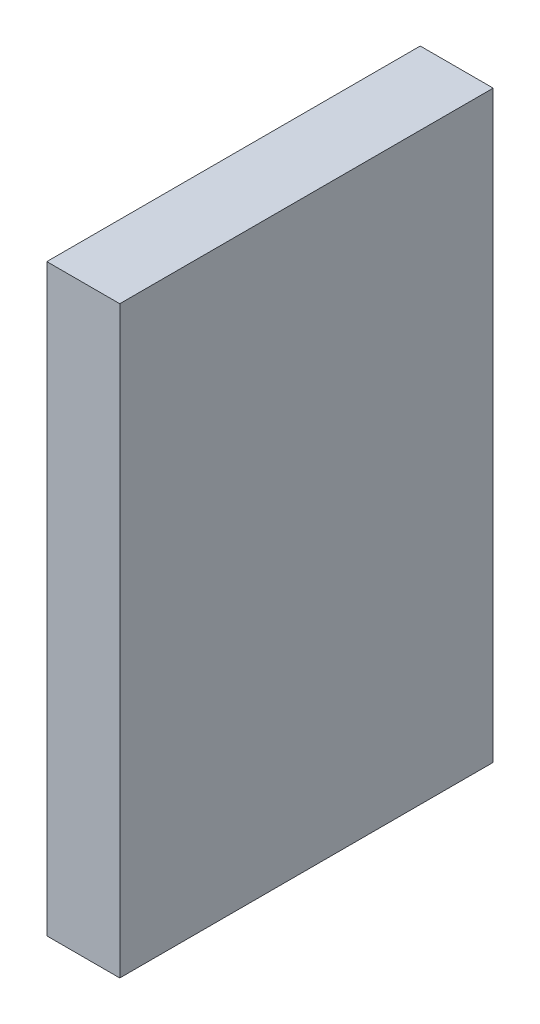
ISO-10303-21;
HEADER;
FILE_DESCRIPTION(('STEP AP214'),'2;1');
FILE_NAME('part.step','',(''),(''),'','','');
FILE_SCHEMA(('AUTOMOTIVE_DESIGN { 1 0 10303 214 1 1 1 1 }'));
ENDSEC;
DATA;
#1=APPLICATION_CONTEXT('core data for automotive mechanical design processes');
#2=APPLICATION_PROTOCOL_DEFINITION('international standard','automotive_design',2000,#1);
#3=PRODUCT_CONTEXT('',#1,'mechanical');
#4=PRODUCT('Part','Part','',(#3));
#5=PRODUCT_RELATED_PRODUCT_CATEGORY('part','',(#4));
#6=PRODUCT_DEFINITION_FORMATION('','',#4);
#7=PRODUCT_DEFINITION_CONTEXT('part definition',#1,'design');
#8=PRODUCT_DEFINITION('design','',#6,#7);
#9=PRODUCT_DEFINITION_SHAPE('','',#8);
#10=(LENGTH_UNIT() NAMED_UNIT(*) SI_UNIT(.MILLI.,.METRE.));
#11=(NAMED_UNIT(*) PLANE_ANGLE_UNIT() SI_UNIT($,.RADIAN.));
#12=(NAMED_UNIT(*) SI_UNIT($,.STERADIAN.) SOLID_ANGLE_UNIT());
#13=UNCERTAINTY_MEASURE_WITH_UNIT(LENGTH_MEASURE(1.E-05),#10,'distance_accuracy_value','');
#14=(GEOMETRIC_REPRESENTATION_CONTEXT(3) GLOBAL_UNCERTAINTY_ASSIGNED_CONTEXT((#13)) GLOBAL_UNIT_ASSIGNED_CONTEXT((#10,
#11,#12)) REPRESENTATION_CONTEXT('',''));
#15=CARTESIAN_POINT('',(0.,0.,0.));
#16=DIRECTION('',(0.,0.,1.));
#17=DIRECTION('',(1.,0.,0.));
#18=AXIS2_PLACEMENT_3D('',#15,#16,#17);
#19=CARTESIAN_POINT('',(0.64949324,-5.19949176,0.));
#20=DIRECTION('',(-1.,0.,0.));
#21=DIRECTION('',(0.,0.,1.));
#22=AXIS2_PLACEMENT_3D('',#19,#20,#21);
#23=PLANE('',#22);
#24=DIRECTION('',(0.,0.,-1.));
#25=VECTOR('',#24,1.);
#26=CARTESIAN_POINT('',(0.64949324,5.1994943,0.));
#27=LINE('',#26,#25);
#28=CARTESIAN_POINT('',(0.64949324,5.1994943,0.));
#29=VERTEX_POINT('',#28);
#30=CARTESIAN_POINT('',(0.64949324,5.1994943,6.65000194));
#31=VERTEX_POINT('',#30);
#32=EDGE_CURVE('E20',#29,#31,#27,.F.);
#33=ORIENTED_EDGE('',*,*,#32,.T.);
#34=DIRECTION('',(0.,1.,0.));
#35=VECTOR('',#34,1.);
#36=CARTESIAN_POINT('',(0.64949324,5.1994943,6.65000194));
#37=LINE('',#36,#35);
#38=CARTESIAN_POINT('',(0.64949324,-5.19949176,6.65000194));
#39=VERTEX_POINT('',#38);
#40=EDGE_CURVE('E55',#31,#39,#37,.F.);
#41=ORIENTED_EDGE('',*,*,#40,.T.);
#42=DIRECTION('',(0.,0.,1.));
#43=VECTOR('',#42,1.);
#44=CARTESIAN_POINT('',(0.64949324,-5.19949176,0.));
#45=LINE('',#44,#43);
#46=CARTESIAN_POINT('',(0.64949324,-5.19949176,0.));
#47=VERTEX_POINT('',#46);
#48=EDGE_CURVE('E76',#39,#47,#45,.F.);
#49=ORIENTED_EDGE('',*,*,#48,.T.);
#50=DIRECTION('',(0.,1.,0.));
#51=VECTOR('',#50,1.);
#52=CARTESIAN_POINT('',(0.64949324,5.1994943,0.));
#53=LINE('',#52,#51);
#54=EDGE_CURVE('E58',#29,#47,#53,.F.);
#55=ORIENTED_EDGE('',*,*,#54,.F.);
#56=EDGE_LOOP('',(#33,#41,#49,#55));
#57=FACE_BOUND('',#56,.T.);
#58=ADVANCED_FACE('F17',(#57),#23,.F.);
#59=CARTESIAN_POINT('',(0.64949324,5.1994943,0.));
#60=DIRECTION('',(0.,-1.,0.));
#61=DIRECTION('',(0.,0.,-1.));
#62=AXIS2_PLACEMENT_3D('',#59,#60,#61);
#63=PLANE('',#62);
#64=DIRECTION('',(0.,0.,-1.));
#65=VECTOR('',#64,1.);
#66=CARTESIAN_POINT('',(-0.6494907,5.1994943,0.));
#67=LINE('',#66,#65);
#68=CARTESIAN_POINT('',(-0.6494907,5.1994943,0.));
#69=VERTEX_POINT('',#68);
#70=CARTESIAN_POINT('',(-0.6494907,5.1994943,6.65000194));
#71=VERTEX_POINT('',#70);
#72=EDGE_CURVE('E73',#69,#71,#67,.F.);
#73=ORIENTED_EDGE('',*,*,#72,.T.);
#74=DIRECTION('',(-1.,0.,0.));
#75=VECTOR('',#74,1.);
#76=CARTESIAN_POINT('',(-0.6494907,5.1994943,6.65000194));
#77=LINE('',#76,#75);
#78=EDGE_CURVE('E63',#71,#31,#77,.F.);
#79=ORIENTED_EDGE('',*,*,#78,.T.);
#80=ORIENTED_EDGE('',*,*,#32,.F.);
#81=DIRECTION('',(-1.,0.,0.));
#82=VECTOR('',#81,1.);
#83=CARTESIAN_POINT('',(-0.6494907,5.1994943,0.));
#84=LINE('',#83,#82);
#85=EDGE_CURVE('E78',#69,#29,#84,.F.);
#86=ORIENTED_EDGE('',*,*,#85,.F.);
#87=EDGE_LOOP('',(#73,#79,#80,#86));
#88=FACE_BOUND('',#87,.T.);
#89=ADVANCED_FACE('F72',(#88),#63,.F.);
#90=CARTESIAN_POINT('',(-0.6494907,5.1994943,6.65000194));
#91=DIRECTION('',(0.,0.,-1.));
#92=DIRECTION('',(-1.,0.,0.));
#93=AXIS2_PLACEMENT_3D('',#90,#91,#92);
#94=PLANE('',#93);
#95=DIRECTION('',(1.,0.,0.));
#96=VECTOR('',#95,1.);
#97=CARTESIAN_POINT('',(-0.6494907,-5.19949176,6.65000194));
#98=LINE('',#97,#96);
#99=CARTESIAN_POINT('',(-0.6494907,-5.19949176,6.65000194));
#100=VERTEX_POINT('',#99);
#101=EDGE_CURVE('E69',#100,#39,#98,.T.);
#102=ORIENTED_EDGE('',*,*,#101,.T.);
#103=ORIENTED_EDGE('',*,*,#40,.F.);
#104=ORIENTED_EDGE('',*,*,#78,.F.);
#105=DIRECTION('',(0.,1.,0.));
#106=VECTOR('',#105,1.);
#107=CARTESIAN_POINT('',(-0.6494907,5.1994943,6.65000194));
#108=LINE('',#107,#106);
#109=EDGE_CURVE('E83',#71,#100,#108,.F.);
#110=ORIENTED_EDGE('',*,*,#109,.T.);
#111=EDGE_LOOP('',(#102,#103,#104,#110));
#112=FACE_BOUND('',#111,.T.);
#113=ADVANCED_FACE('F66',(#112),#94,.F.);
#114=CARTESIAN_POINT('',(-0.6494907,-5.19949176,0.));
#115=DIRECTION('',(0.,1.,0.));
#116=DIRECTION('',(0.,0.,1.));
#117=AXIS2_PLACEMENT_3D('',#114,#115,#116);
#118=PLANE('',#117);
#119=ORIENTED_EDGE('',*,*,#48,.F.);
#120=ORIENTED_EDGE('',*,*,#101,.F.);
#121=DIRECTION('',(0.,0.,-1.));
#122=VECTOR('',#121,1.);
#123=CARTESIAN_POINT('',(-0.6494907,-5.19949176,0.));
#124=LINE('',#123,#122);
#125=CARTESIAN_POINT('',(-0.6494907,-5.19949176,0.));
#126=VERTEX_POINT('',#125);
#127=EDGE_CURVE('E26',#100,#126,#124,.T.);
#128=ORIENTED_EDGE('',*,*,#127,.T.);
#129=DIRECTION('',(-1.,0.,0.));
#130=VECTOR('',#129,1.);
#131=CARTESIAN_POINT('',(-0.6494907,-5.19949176,0.));
#132=LINE('',#131,#130);
#133=EDGE_CURVE('E34',#47,#126,#132,.T.);
#134=ORIENTED_EDGE('',*,*,#133,.F.);
#135=EDGE_LOOP('',(#119,#120,#128,#134));
#136=FACE_BOUND('',#135,.T.);
#137=ADVANCED_FACE('F88',(#136),#118,.F.);
#138=CARTESIAN_POINT('',(-0.6494907,5.1994943,0.));
#139=DIRECTION('',(0.,0.,-1.));
#140=DIRECTION('',(-1.,0.,0.));
#141=AXIS2_PLACEMENT_3D('',#138,#139,#140);
#142=PLANE('',#141);
#143=ORIENTED_EDGE('',*,*,#133,.T.);
#144=DIRECTION('',(0.,1.,0.));
#145=VECTOR('',#144,1.);
#146=CARTESIAN_POINT('',(-0.6494907,5.1994943,0.));
#147=LINE('',#146,#145);
#148=EDGE_CURVE('E11',#126,#69,#147,.T.);
#149=ORIENTED_EDGE('',*,*,#148,.T.);
#150=ORIENTED_EDGE('',*,*,#85,.T.);
#151=ORIENTED_EDGE('',*,*,#54,.T.);
#152=EDGE_LOOP('',(#143,#149,#150,#151));
#153=FACE_BOUND('',#152,.T.);
#154=ADVANCED_FACE('F91',(#153),#142,.T.);
#155=CARTESIAN_POINT('',(-0.6494907,5.1994943,0.));
#156=DIRECTION('',(1.,0.,0.));
#157=DIRECTION('',(0.,0.,-1.));
#158=AXIS2_PLACEMENT_3D('',#155,#156,#157);
#159=PLANE('',#158);
#160=ORIENTED_EDGE('',*,*,#127,.F.);
#161=ORIENTED_EDGE('',*,*,#109,.F.);
#162=ORIENTED_EDGE('',*,*,#72,.F.);
#163=ORIENTED_EDGE('',*,*,#148,.F.);
#164=EDGE_LOOP('',(#160,#161,#162,#163));
#165=FACE_BOUND('',#164,.T.);
#166=ADVANCED_FACE('F90',(#165),#159,.F.);
#167=CLOSED_SHELL('',(#58,#89,#113,#137,#154,#166));
#168=MANIFOLD_SOLID_BREP('B1',#167);
#169=ADVANCED_BREP_SHAPE_REPRESENTATION('',(#18,#168),#14);
#170=SHAPE_DEFINITION_REPRESENTATION(#9,#169);
ENDSEC;
END-ISO-10303-21;
